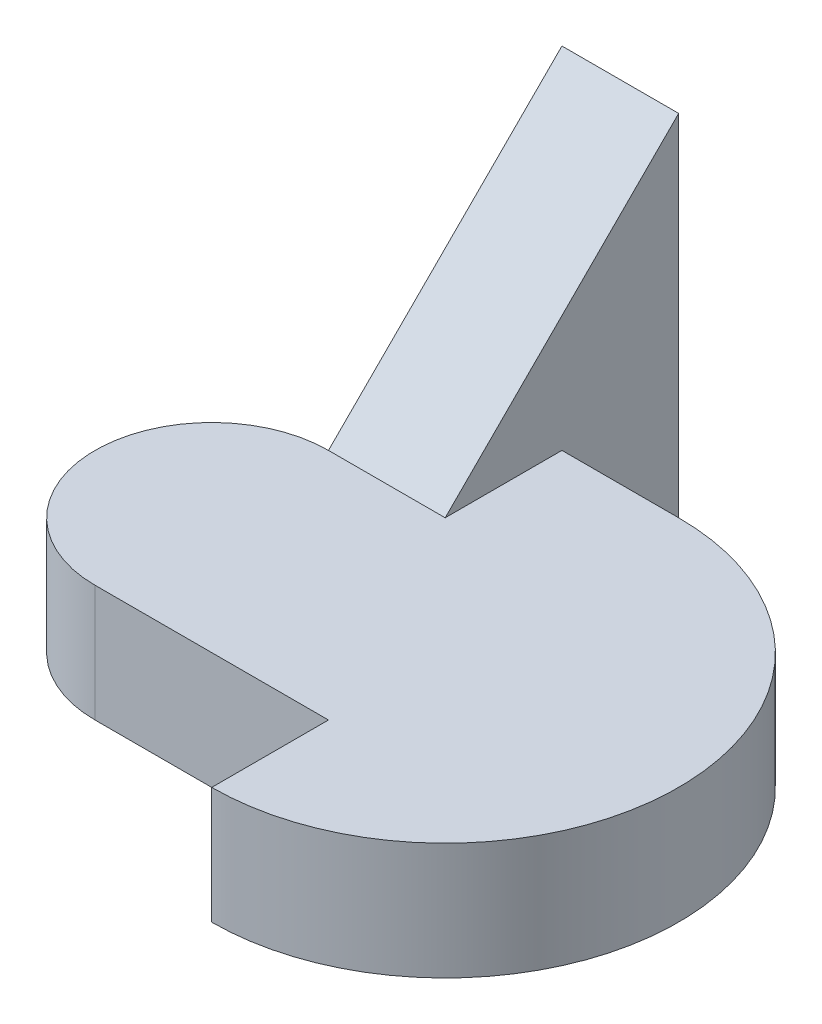
ISO-10303-21;
HEADER;
FILE_DESCRIPTION(('STEP AP214'),'2;1');
FILE_NAME('part.step','',(''),(''),'','','');
FILE_SCHEMA(('AUTOMOTIVE_DESIGN { 1 0 10303 214 1 1 1 1 }'));
ENDSEC;
DATA;
#1=APPLICATION_CONTEXT('core data for automotive mechanical design processes');
#2=APPLICATION_PROTOCOL_DEFINITION('international standard','automotive_design',2000,#1);
#3=PRODUCT_CONTEXT('',#1,'mechanical');
#4=PRODUCT('Part','Part','',(#3));
#5=PRODUCT_RELATED_PRODUCT_CATEGORY('part','',(#4));
#6=PRODUCT_DEFINITION_FORMATION('','',#4);
#7=PRODUCT_DEFINITION_CONTEXT('part definition',#1,'design');
#8=PRODUCT_DEFINITION('design','',#6,#7);
#9=PRODUCT_DEFINITION_SHAPE('','',#8);
#10=(LENGTH_UNIT() NAMED_UNIT(*) SI_UNIT(.MILLI.,.METRE.));
#11=(NAMED_UNIT(*) PLANE_ANGLE_UNIT() SI_UNIT($,.RADIAN.));
#12=(NAMED_UNIT(*) SI_UNIT($,.STERADIAN.) SOLID_ANGLE_UNIT());
#13=UNCERTAINTY_MEASURE_WITH_UNIT(LENGTH_MEASURE(1.E-05),#10,'distance_accuracy_value','');
#14=(GEOMETRIC_REPRESENTATION_CONTEXT(3) GLOBAL_UNCERTAINTY_ASSIGNED_CONTEXT((#13)) GLOBAL_UNIT_ASSIGNED_CONTEXT((#10,
#11,#12)) REPRESENTATION_CONTEXT('',''));
#15=CARTESIAN_POINT('',(0.,0.,0.));
#16=DIRECTION('',(0.,0.,1.));
#17=DIRECTION('',(1.,0.,0.));
#18=AXIS2_PLACEMENT_3D('',#15,#16,#17);
#19=CARTESIAN_POINT('',(-2.13004290186987,3.5537761661327,-2.41288186672105));
#20=DIRECTION('',(1.,0.,0.));
#21=DIRECTION('',(0.,0.,-1.));
#22=AXIS2_PLACEMENT_3D('',#19,#20,#21);
#23=PLANE('',#22);
#24=DIRECTION('',(0.,0.,1.));
#25=VECTOR('',#24,1.);
#26=CARTESIAN_POINT('',(-2.13004290186987,2.5537761661327,-2.41288186672105));
#27=LINE('',#26,#25);
#28=CARTESIAN_POINT('',(-2.13004290186987,2.5537761661327,-1.41288186672105));
#29=VERTEX_POINT('',#28);
#30=CARTESIAN_POINT('',(-2.13004290186987,2.5537761661327,-0.412881866721052));
#31=VERTEX_POINT('',#30);
#32=EDGE_CURVE('E131',#29,#31,#27,.T.);
#33=ORIENTED_EDGE('',*,*,#32,.T.);
#34=DIRECTION('',(0.,-1.,0.));
#35=VECTOR('',#34,1.);
#36=CARTESIAN_POINT('',(-2.13004290186987,3.5537761661327,-0.412881866721052));
#37=LINE('',#36,#35);
#38=CARTESIAN_POINT('',(-2.13004290186987,3.5537761661327,-0.412881866721052));
#39=VERTEX_POINT('',#38);
#40=EDGE_CURVE('E11',#39,#31,#37,.T.);
#41=ORIENTED_EDGE('',*,*,#40,.F.);
#42=DIRECTION('',(0.,0.,1.));
#43=VECTOR('',#42,1.);
#44=CARTESIAN_POINT('',(-2.13004290186987,3.5537761661327,-2.41288186672105));
#45=LINE('',#44,#43);
#46=CARTESIAN_POINT('',(-2.13004290186987,3.5537761661327,-1.41288186672105));
#47=VERTEX_POINT('',#46);
#48=EDGE_CURVE('E140',#47,#39,#45,.T.);
#49=ORIENTED_EDGE('',*,*,#48,.F.);
#50=DIRECTION('',(0.,-1.,0.));
#51=VECTOR('',#50,1.);
#52=CARTESIAN_POINT('',(-2.13004290186987,3.5537761661327,-1.41288186672105));
#53=LINE('',#52,#51);
#54=EDGE_CURVE('E130',#47,#29,#53,.T.);
#55=ORIENTED_EDGE('',*,*,#54,.T.);
#56=EDGE_LOOP('',(#33,#41,#49,#55));
#57=FACE_BOUND('',#56,.T.);
#58=ADVANCED_FACE('F38',(#57),#23,.F.);
#59=CARTESIAN_POINT('',(-2.13004290186987,3.5537761661327,-2.41288186672105));
#60=DIRECTION('',(0.,-1.,0.));
#61=DIRECTION('',(0.,0.,-1.));
#62=AXIS2_PLACEMENT_3D('',#59,#60,#61);
#63=CYLINDRICAL_SURFACE('',#62,2.);
#64=CARTESIAN_POINT('',(-2.13004290186987,2.5537761661327,-2.41288186672105));
#65=DIRECTION('',(0.,1.,0.));
#66=DIRECTION('',(0.,0.,1.));
#67=AXIS2_PLACEMENT_3D('',#64,#65,#66);
#68=CIRCLE('',#67,2.);
#69=CARTESIAN_POINT('',(-2.13004290186987,2.5537761661327,-4.41288186672105));
#70=VERTEX_POINT('',#69);
#71=EDGE_CURVE('E134',#31,#70,#68,.T.);
#72=ORIENTED_EDGE('',*,*,#71,.T.);
#73=DIRECTION('',(0.,-1.,0.));
#74=VECTOR('',#73,1.);
#75=CARTESIAN_POINT('',(-2.13004290186987,3.5537761661327,-4.41288186672105));
#76=LINE('',#75,#74);
#77=CARTESIAN_POINT('',(-2.13004290186987,3.5537761661327,-4.41288186672105));
#78=VERTEX_POINT('',#77);
#79=EDGE_CURVE('E46',#78,#70,#76,.T.);
#80=ORIENTED_EDGE('',*,*,#79,.F.);
#81=CARTESIAN_POINT('',(-2.13004290186987,3.5537761661327,-2.41288186672105));
#82=DIRECTION('',(0.,1.,0.));
#83=DIRECTION('',(0.,0.,1.));
#84=AXIS2_PLACEMENT_3D('',#81,#82,#83);
#85=CIRCLE('',#84,2.);
#86=EDGE_CURVE('E89',#39,#78,#85,.T.);
#87=ORIENTED_EDGE('',*,*,#86,.F.);
#88=ORIENTED_EDGE('',*,*,#40,.T.);
#89=EDGE_LOOP('',(#72,#80,#87,#88));
#90=FACE_BOUND('',#89,.T.);
#91=ADVANCED_FACE('F170',(#90),#63,.T.);
#92=CARTESIAN_POINT('',(-2.13004290186987,3.5537761661327,-4.41288186672105));
#93=DIRECTION('',(0.,0.,1.));
#94=DIRECTION('',(1.,0.,0.));
#95=AXIS2_PLACEMENT_3D('',#92,#93,#94);
#96=PLANE('',#95);
#97=DIRECTION('',(-1.,0.,0.));
#98=VECTOR('',#97,1.);
#99=CARTESIAN_POINT('',(-2.13004290186987,2.5537761661327,-4.41288186672105));
#100=LINE('',#99,#98);
#101=CARTESIAN_POINT('',(-3.13004290186987,2.5537761661327,-4.41288186672105));
#102=VERTEX_POINT('',#101);
#103=EDGE_CURVE('E111',#70,#102,#100,.T.);
#104=ORIENTED_EDGE('',*,*,#103,.T.);
#105=DIRECTION('',(0.,-1.,0.));
#106=VECTOR('',#105,1.);
#107=CARTESIAN_POINT('',(-3.13004290186987,3.5537761661327,-4.41288186672105));
#108=LINE('',#107,#106);
#109=CARTESIAN_POINT('',(-3.13004290186987,3.5537761661327,-4.41288186672105));
#110=VERTEX_POINT('',#109);
#111=EDGE_CURVE('E108',#110,#102,#108,.T.);
#112=ORIENTED_EDGE('',*,*,#111,.F.);
#113=DIRECTION('',(-1.,0.,0.));
#114=VECTOR('',#113,1.);
#115=CARTESIAN_POINT('',(-2.13004290186987,3.5537761661327,-4.41288186672105));
#116=LINE('',#115,#114);
#117=EDGE_CURVE('E97',#78,#110,#116,.T.);
#118=ORIENTED_EDGE('',*,*,#117,.F.);
#119=ORIENTED_EDGE('',*,*,#79,.T.);
#120=EDGE_LOOP('',(#104,#112,#118,#119));
#121=FACE_BOUND('',#120,.T.);
#122=ADVANCED_FACE('F109',(#121),#96,.F.);
#123=CARTESIAN_POINT('',(-4.13004290186987,3.5537761661327,-2.41288186672105));
#124=DIRECTION('',(0.,-1.,0.));
#125=DIRECTION('',(0.,0.,-1.));
#126=AXIS2_PLACEMENT_3D('',#123,#124,#125);
#127=CYLINDRICAL_SURFACE('',#126,1.);
#128=CARTESIAN_POINT('',(-4.13004290186987,2.5537761661327,-2.41288186672105));
#129=DIRECTION('',(0.,1.,0.));
#130=DIRECTION('',(0.,0.,1.));
#131=AXIS2_PLACEMENT_3D('',#128,#129,#130);
#132=CIRCLE('',#131,1.);
#133=CARTESIAN_POINT('',(-4.13004290186987,2.5537761661327,-3.41288186672105));
#134=VERTEX_POINT('',#133);
#135=CARTESIAN_POINT('',(-4.13004290186987,2.5537761661327,-1.41288186672105));
#136=VERTEX_POINT('',#135);
#137=EDGE_CURVE('E75',#134,#136,#132,.T.);
#138=ORIENTED_EDGE('',*,*,#137,.T.);
#139=DIRECTION('',(0.,-1.,0.));
#140=VECTOR('',#139,1.);
#141=CARTESIAN_POINT('',(-4.13004290186987,3.5537761661327,-1.41288186672105));
#142=LINE('',#141,#140);
#143=CARTESIAN_POINT('',(-4.13004290186987,3.5537761661327,-1.41288186672105));
#144=VERTEX_POINT('',#143);
#145=EDGE_CURVE('E142',#144,#136,#142,.T.);
#146=ORIENTED_EDGE('',*,*,#145,.F.);
#147=CARTESIAN_POINT('',(-4.13004290186987,3.5537761661327,-2.41288186672105));
#148=DIRECTION('',(0.,1.,0.));
#149=DIRECTION('',(0.,0.,1.));
#150=AXIS2_PLACEMENT_3D('',#147,#148,#149);
#151=CIRCLE('',#150,1.);
#152=CARTESIAN_POINT('',(-4.13004290186987,3.5537761661327,-3.41288186672105));
#153=VERTEX_POINT('',#152);
#154=EDGE_CURVE('E124',#153,#144,#151,.T.);
#155=ORIENTED_EDGE('',*,*,#154,.F.);
#156=DIRECTION('',(0.,-1.,0.));
#157=VECTOR('',#156,1.);
#158=CARTESIAN_POINT('',(-4.13004290186987,3.5537761661327,-3.41288186672105));
#159=LINE('',#158,#157);
#160=EDGE_CURVE('E115',#153,#134,#159,.T.);
#161=ORIENTED_EDGE('',*,*,#160,.T.);
#162=EDGE_LOOP('',(#138,#146,#155,#161));
#163=FACE_BOUND('',#162,.T.);
#164=ADVANCED_FACE('F176',(#163),#127,.T.);
#165=CARTESIAN_POINT('',(-2.13004290186987,3.5537761661327,-1.41288186672105));
#166=DIRECTION('',(0.,0.,-1.));
#167=DIRECTION('',(-1.,0.,0.));
#168=AXIS2_PLACEMENT_3D('',#165,#166,#167);
#169=PLANE('',#168);
#170=DIRECTION('',(1.,0.,0.));
#171=VECTOR('',#170,1.);
#172=CARTESIAN_POINT('',(-2.13004290186987,2.5537761661327,-1.41288186672105));
#173=LINE('',#172,#171);
#174=EDGE_CURVE('E81',#136,#29,#173,.T.);
#175=ORIENTED_EDGE('',*,*,#174,.T.);
#176=ORIENTED_EDGE('',*,*,#54,.F.);
#177=DIRECTION('',(1.,0.,0.));
#178=VECTOR('',#177,1.);
#179=CARTESIAN_POINT('',(-2.13004290186987,3.5537761661327,-1.41288186672105));
#180=LINE('',#179,#178);
#181=EDGE_CURVE('E54',#144,#47,#180,.T.);
#182=ORIENTED_EDGE('',*,*,#181,.F.);
#183=ORIENTED_EDGE('',*,*,#145,.T.);
#184=EDGE_LOOP('',(#175,#176,#182,#183));
#185=FACE_BOUND('',#184,.T.);
#186=ADVANCED_FACE('F181',(#185),#169,.F.);
#187=CARTESIAN_POINT('',(-2.13004290186987,3.5537761661327,-2.41288186672105));
#188=DIRECTION('',(0.,1.,0.));
#189=DIRECTION('',(0.,0.,1.));
#190=AXIS2_PLACEMENT_3D('',#187,#188,#189);
#191=PLANE('',#190);
#192=DIRECTION('',(0.,0.,1.));
#193=VECTOR('',#192,1.);
#194=CARTESIAN_POINT('',(-3.13004290186987,3.5537761661327,-2.41288186672105));
#195=LINE('',#194,#193);
#196=CARTESIAN_POINT('',(-3.13004290186987,3.5537761661327,-3.41288186672105));
#197=VERTEX_POINT('',#196);
#198=EDGE_CURVE('E103',#110,#197,#195,.T.);
#199=ORIENTED_EDGE('',*,*,#198,.T.);
#200=DIRECTION('',(-1.,0.,0.));
#201=VECTOR('',#200,1.);
#202=CARTESIAN_POINT('',(-2.13004290186987,3.5537761661327,-3.41288186672105));
#203=LINE('',#202,#201);
#204=EDGE_CURVE('E122',#197,#153,#203,.T.);
#205=ORIENTED_EDGE('',*,*,#204,.T.);
#206=ORIENTED_EDGE('',*,*,#154,.T.);
#207=ORIENTED_EDGE('',*,*,#181,.T.);
#208=ORIENTED_EDGE('',*,*,#48,.T.);
#209=ORIENTED_EDGE('',*,*,#86,.T.);
#210=ORIENTED_EDGE('',*,*,#117,.T.);
#211=EDGE_LOOP('',(#199,#205,#206,#207,#208,#209,#210));
#212=FACE_BOUND('',#211,.T.);
#213=ADVANCED_FACE('F99',(#212),#191,.T.);
#214=CARTESIAN_POINT('',(-2.13004290186987,2.5537761661327,-2.41288186672105));
#215=DIRECTION('',(0.,1.,0.));
#216=DIRECTION('',(0.,0.,1.));
#217=AXIS2_PLACEMENT_3D('',#214,#215,#216);
#218=PLANE('',#217);
#219=ORIENTED_EDGE('',*,*,#32,.F.);
#220=ORIENTED_EDGE('',*,*,#174,.F.);
#221=ORIENTED_EDGE('',*,*,#137,.F.);
#222=DIRECTION('',(0.,0.,-1.));
#223=VECTOR('',#222,1.);
#224=CARTESIAN_POINT('',(-4.13004290186987,2.5537761661327,-2.41288186672105));
#225=LINE('',#224,#223);
#226=CARTESIAN_POINT('',(-4.13004290186987,2.5537761661327,-5.41288186672105));
#227=VERTEX_POINT('',#226);
#228=EDGE_CURVE('E154',#134,#227,#225,.T.);
#229=ORIENTED_EDGE('',*,*,#228,.T.);
#230=DIRECTION('',(1.,0.,0.));
#231=VECTOR('',#230,1.);
#232=CARTESIAN_POINT('',(-2.13004290186987,2.5537761661327,-5.41288186672105));
#233=LINE('',#232,#231);
#234=CARTESIAN_POINT('',(-3.13004290186987,2.5537761661327,-5.41288186672105));
#235=VERTEX_POINT('',#234);
#236=EDGE_CURVE('E152',#227,#235,#233,.T.);
#237=ORIENTED_EDGE('',*,*,#236,.T.);
#238=DIRECTION('',(0.,0.,1.));
#239=VECTOR('',#238,1.);
#240=CARTESIAN_POINT('',(-3.13004290186987,2.5537761661327,-2.41288186672105));
#241=LINE('',#240,#239);
#242=EDGE_CURVE('E148',#235,#102,#241,.T.);
#243=ORIENTED_EDGE('',*,*,#242,.T.);
#244=ORIENTED_EDGE('',*,*,#103,.F.);
#245=ORIENTED_EDGE('',*,*,#71,.F.);
#246=EDGE_LOOP('',(#219,#220,#221,#229,#237,#243,#244,#245));
#247=FACE_BOUND('',#246,.T.);
#248=ADVANCED_FACE('F146',(#247),#218,.F.);
#249=CARTESIAN_POINT('',(-3.13004290186987,5.5537761661327,-2.41288186672105));
#250=DIRECTION('',(1.,0.,0.));
#251=DIRECTION('',(0.,0.,-1.));
#252=AXIS2_PLACEMENT_3D('',#249,#250,#251);
#253=PLANE('',#252);
#254=DIRECTION('',(0.,0.707106781186547,-0.707106781186548));
#255=VECTOR('',#254,1.);
#256=CARTESIAN_POINT('',(-3.13004290186987,4.0537761661327,-3.91288186672105));
#257=LINE('',#256,#255);
#258=CARTESIAN_POINT('',(-3.13004290186987,5.5537761661327,-5.41288186672105));
#259=VERTEX_POINT('',#258);
#260=EDGE_CURVE('E121',#197,#259,#257,.T.);
#261=ORIENTED_EDGE('',*,*,#260,.F.);
#262=ORIENTED_EDGE('',*,*,#198,.F.);
#263=ORIENTED_EDGE('',*,*,#111,.T.);
#264=ORIENTED_EDGE('',*,*,#242,.F.);
#265=DIRECTION('',(0.,-1.,0.));
#266=VECTOR('',#265,1.);
#267=CARTESIAN_POINT('',(-3.13004290186987,5.5537761661327,-5.41288186672105));
#268=LINE('',#267,#266);
#269=EDGE_CURVE('E135',#259,#235,#268,.T.);
#270=ORIENTED_EDGE('',*,*,#269,.F.);
#271=EDGE_LOOP('',(#261,#262,#263,#264,#270));
#272=FACE_BOUND('',#271,.T.);
#273=ADVANCED_FACE('F118',(#272),#253,.T.);
#274=CARTESIAN_POINT('',(-2.13004290186987,5.5537761661327,-5.41288186672105));
#275=DIRECTION('',(0.,0.,-1.));
#276=DIRECTION('',(-1.,0.,0.));
#277=AXIS2_PLACEMENT_3D('',#274,#275,#276);
#278=PLANE('',#277);
#279=ORIENTED_EDGE('',*,*,#236,.F.);
#280=DIRECTION('',(0.,-1.,0.));
#281=VECTOR('',#280,1.);
#282=CARTESIAN_POINT('',(-4.13004290186987,5.5537761661327,-5.41288186672105));
#283=LINE('',#282,#281);
#284=CARTESIAN_POINT('',(-4.13004290186987,5.5537761661327,-5.41288186672105));
#285=VERTEX_POINT('',#284);
#286=EDGE_CURVE('E162',#285,#227,#283,.T.);
#287=ORIENTED_EDGE('',*,*,#286,.F.);
#288=DIRECTION('',(1.,0.,0.));
#289=VECTOR('',#288,1.);
#290=CARTESIAN_POINT('',(-2.13004290186987,5.5537761661327,-5.41288186672105));
#291=LINE('',#290,#289);
#292=EDGE_CURVE('E159',#285,#259,#291,.T.);
#293=ORIENTED_EDGE('',*,*,#292,.T.);
#294=ORIENTED_EDGE('',*,*,#269,.T.);
#295=EDGE_LOOP('',(#279,#287,#293,#294));
#296=FACE_BOUND('',#295,.T.);
#297=ADVANCED_FACE('F190',(#296),#278,.T.);
#298=CARTESIAN_POINT('',(-4.13004290186987,5.5537761661327,-2.41288186672105));
#299=DIRECTION('',(-1.,0.,0.));
#300=DIRECTION('',(0.,0.,1.));
#301=AXIS2_PLACEMENT_3D('',#298,#299,#300);
#302=PLANE('',#301);
#303=DIRECTION('',(0.,-0.707106781186547,0.707106781186548));
#304=VECTOR('',#303,1.);
#305=CARTESIAN_POINT('',(-4.13004290186987,5.5537761661327,-5.41288186672105));
#306=LINE('',#305,#304);
#307=EDGE_CURVE('E156',#285,#153,#306,.T.);
#308=ORIENTED_EDGE('',*,*,#307,.F.);
#309=ORIENTED_EDGE('',*,*,#286,.T.);
#310=ORIENTED_EDGE('',*,*,#228,.F.);
#311=ORIENTED_EDGE('',*,*,#160,.F.);
#312=EDGE_LOOP('',(#308,#309,#310,#311));
#313=FACE_BOUND('',#312,.T.);
#314=ADVANCED_FACE('F193',(#313),#302,.T.);
#315=CARTESIAN_POINT('',(-1.13004290186987,5.5537761661327,-5.41288186672105));
#316=DIRECTION('',(0.,-0.707106781186548,-0.707106781186547));
#317=DIRECTION('',(0.,0.707106781186547,-0.707106781186548));
#318=AXIS2_PLACEMENT_3D('',#315,#316,#317);
#319=PLANE('',#318);
#320=ORIENTED_EDGE('',*,*,#260,.T.);
#321=ORIENTED_EDGE('',*,*,#292,.F.);
#322=ORIENTED_EDGE('',*,*,#307,.T.);
#323=ORIENTED_EDGE('',*,*,#204,.F.);
#324=EDGE_LOOP('',(#320,#321,#322,#323));
#325=FACE_BOUND('',#324,.T.);
#326=ADVANCED_FACE('F197',(#325),#319,.F.);
#327=CLOSED_SHELL('',(#58,#91,#122,#164,#186,#213,#248,#273,#297,#314,#326));
#328=MANIFOLD_SOLID_BREP('B2',#327);
#329=ADVANCED_BREP_SHAPE_REPRESENTATION('',(#18,#328),#14);
#330=SHAPE_DEFINITION_REPRESENTATION(#9,#329);
ENDSEC;
END-ISO-10303-21;
